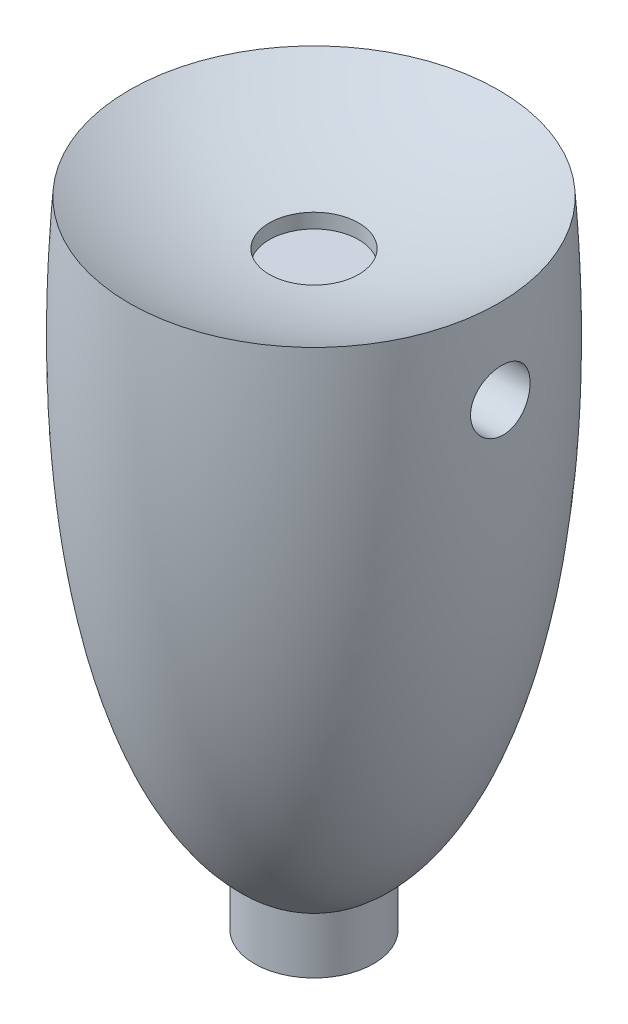
ISO-10303-21;
HEADER;
FILE_DESCRIPTION(('STEP AP214'),'2;1');
FILE_NAME('part.step','',(''),(''),'','','');
FILE_SCHEMA(('AUTOMOTIVE_DESIGN { 1 0 10303 214 1 1 1 1 }'));
ENDSEC;
DATA;
#1=APPLICATION_CONTEXT('core data for automotive mechanical design processes');
#2=APPLICATION_PROTOCOL_DEFINITION('international standard','automotive_design',2000,#1);
#3=PRODUCT_CONTEXT('',#1,'mechanical');
#4=PRODUCT('Part','Part','',(#3));
#5=PRODUCT_RELATED_PRODUCT_CATEGORY('part','',(#4));
#6=PRODUCT_DEFINITION_FORMATION('','',#4);
#7=PRODUCT_DEFINITION_CONTEXT('part definition',#1,'design');
#8=PRODUCT_DEFINITION('design','',#6,#7);
#9=PRODUCT_DEFINITION_SHAPE('','',#8);
#10=(LENGTH_UNIT() NAMED_UNIT(*) SI_UNIT(.MILLI.,.METRE.));
#11=(NAMED_UNIT(*) PLANE_ANGLE_UNIT() SI_UNIT($,.RADIAN.));
#12=(NAMED_UNIT(*) SI_UNIT($,.STERADIAN.) SOLID_ANGLE_UNIT());
#13=UNCERTAINTY_MEASURE_WITH_UNIT(LENGTH_MEASURE(1.E-05),#10,'distance_accuracy_value','');
#14=(GEOMETRIC_REPRESENTATION_CONTEXT(3) GLOBAL_UNCERTAINTY_ASSIGNED_CONTEXT((#13)) GLOBAL_UNIT_ASSIGNED_CONTEXT((#10,
#11,#12)) REPRESENTATION_CONTEXT('',''));
#15=CARTESIAN_POINT('',(0.,0.,0.));
#16=DIRECTION('',(0.,0.,1.));
#17=DIRECTION('',(1.,0.,0.));
#18=AXIS2_PLACEMENT_3D('',#15,#16,#17);
#19=CARTESIAN_POINT('',(0.,-10.1519784077534,0.));
#20=CARTESIAN_POINT('',(2.17764254721948,-9.8573338842702,0.));
#21=CARTESIAN_POINT('',(3.51506536185623,-5.79349801081051,0.));
#22=CARTESIAN_POINT('',(3.1,0.,0.));
#23=B_SPLINE_CURVE_WITH_KNOTS('',3,(#19,#20,#21,#22),.UNSPECIFIED.,.F.,.F.,(4,4),(0.,1.),.UNSPECIFIED.);
#24=CARTESIAN_POINT('',(0.,-10.1519784077534,0.));
#25=DIRECTION('',(0.,-1.,0.));
#26=AXIS1_PLACEMENT('',#24,#25);
#27=SURFACE_OF_REVOLUTION('',#23,#26);
#28=CARTESIAN_POINT('',(0.,-9.71155117708595,0.));
#29=DIRECTION('',(0.,-1.,0.));
#30=DIRECTION('',(0.,0.,-1.));
#31=AXIS2_PLACEMENT_3D('',#28,#29,#30);
#32=CIRCLE('',#31,1.);
#33=CARTESIAN_POINT('',(0.,-9.71155117708595,-1.));
#34=VERTEX_POINT('',#33);
#35=EDGE_CURVE('E11',#34,#34,#32,.T.);
#36=ORIENTED_EDGE('',*,*,#35,.F.);
#37=EDGE_LOOP('',(#36));
#38=FACE_BOUND('',#37,.T.);
#39=CARTESIAN_POINT('',(0.,0.,0.));
#40=DIRECTION('',(0.,-1.,0.));
#41=DIRECTION('',(0.,0.,-1.));
#42=AXIS2_PLACEMENT_3D('',#39,#40,#41);
#43=CIRCLE('',#42,3.1);
#44=CARTESIAN_POINT('',(0.,0.,-3.1));
#45=VERTEX_POINT('',#44);
#46=EDGE_CURVE('E49',#45,#45,#43,.T.);
#47=ORIENTED_EDGE('',*,*,#46,.T.);
#48=EDGE_LOOP('',(#47));
#49=FACE_BOUND('',#48,.T.);
#50=CARTESIAN_POINT('',(3.17478547305624,-1.87731371299007,0.));
#51=CARTESIAN_POINT('',(3.17478708095935,-1.87731880184838,-0.0278991793233904));
#52=CARTESIAN_POINT('',(3.17440053766165,-1.87497659899603,-0.0557705429527798));
#53=CARTESIAN_POINT('',(3.17289561225656,-1.8656875755126,-0.110757315431953));
#54=CARTESIAN_POINT('',(3.17177649487449,-1.85873612855486,-0.137871936210802));
#55=CARTESIAN_POINT('',(3.16891619118301,-1.84044363752771,-0.190488959148186));
#56=CARTESIAN_POINT('',(3.16717598888102,-1.82910953470292,-0.215993836883982));
#57=CARTESIAN_POINT('',(3.16323892698663,-1.80236521737027,-0.264775100218677));
#58=CARTESIAN_POINT('',(3.1610414385232,-1.78694938152737,-0.288048351761007));
#59=CARTESIAN_POINT('',(3.15638274285568,-1.75235553650844,-0.331855899819433));
#60=CARTESIAN_POINT('',(3.15391972717289,-1.73315087831825,-0.352368955936288));
#61=CARTESIAN_POINT('',(3.14897616915257,-1.69158380888654,-0.389895327703351));
#62=CARTESIAN_POINT('',(3.14649562636997,-1.66922131718121,-0.406908554148302));
#63=CARTESIAN_POINT('',(3.14172713866212,-1.621752395413,-0.437089505664033));
#64=CARTESIAN_POINT('',(3.13944096207905,-1.59662474242629,-0.450224160537847));
#65=CARTESIAN_POINT('',(3.13529661745251,-1.5445191936671,-0.472058336658953));
#66=CARTESIAN_POINT('',(3.13343784674159,-1.51754397365096,-0.480764124148514));
#67=CARTESIAN_POINT('',(3.13031080139519,-1.46261237734369,-0.4934723680727));
#68=CARTESIAN_POINT('',(3.12903969767751,-1.43466141351258,-0.497497502684638));
#69=CARTESIAN_POINT('',(3.12716452356149,-1.37845908652033,-0.500790323557148));
#70=CARTESIAN_POINT('',(3.12656040958641,-1.35020774310581,-0.500058320639419));
#71=CARTESIAN_POINT('',(3.12603330957158,-1.29449498225612,-0.493881647411546));
#72=CARTESIAN_POINT('',(3.12610382719346,-1.2670285803121,-0.488482379257165));
#73=CARTESIAN_POINT('',(3.12684568825765,-1.21338680141548,-0.473186891796732));
#74=CARTESIAN_POINT('',(3.12751703483141,-1.18721143119237,-0.463290649052981));
#75=CARTESIAN_POINT('',(3.12932945536474,-1.13690660587306,-0.439295470064482));
#76=CARTESIAN_POINT('',(3.13047018215669,-1.11277565453734,-0.425199642079995));
#77=CARTESIAN_POINT('',(3.13304566424098,-1.06716507943588,-0.393173896204928));
#78=CARTESIAN_POINT('',(3.13448092143089,-1.04569008303784,-0.375237431340686));
#79=CARTESIAN_POINT('',(3.1374513615303,-1.00587599909418,-0.33589183622));
#80=CARTESIAN_POINT('',(3.138987228538,-0.987562320901558,-0.314457039480713));
#81=CARTESIAN_POINT('',(3.14193535211081,-0.95481459561071,-0.268851761822396));
#82=CARTESIAN_POINT('',(3.14334781128846,-0.94037410556911,-0.244685920329104));
#83=CARTESIAN_POINT('',(3.1458680220724,-0.915699986292174,-0.194178479893189));
#84=CARTESIAN_POINT('',(3.14697474652728,-0.905480482367736,-0.167829924099216));
#85=CARTESIAN_POINT('',(3.14873065316615,-0.889616595975861,-0.113775404930868));
#86=CARTESIAN_POINT('',(3.14937985379845,-0.883972029036072,-0.0860694963359673));
#87=CARTESIAN_POINT('',(3.15013323159845,-0.877443529933449,-0.0302501556152628));
#88=CARTESIAN_POINT('',(3.15024039415719,-0.876533520383858,-0.00213981277784649));
#89=CARTESIAN_POINT('',(3.14990384833927,-0.879430861900544,0.0538329023684408));
#90=CARTESIAN_POINT('',(3.14946015032202,-0.883238124254565,0.0816952793305937));
#91=CARTESIAN_POINT('',(3.14808234823101,-0.895433361380588,0.136272753409917));
#92=CARTESIAN_POINT('',(3.14715012939539,-0.90380373174722,0.162991836795549));
#93=CARTESIAN_POINT('',(3.14491571186426,-0.92488583044875,0.214684112276624));
#94=CARTESIAN_POINT('',(3.14361300553247,-0.937603520275983,0.23965484990609));
#95=CARTESIAN_POINT('',(3.14080318281096,-0.96707802444443,0.287215208650524));
#96=CARTESIAN_POINT('',(3.13929525389411,-0.983851111166654,0.309794696209833));
#97=CARTESIAN_POINT('',(3.13628255582949,-1.02093970144595,0.351828381788151));
#98=CARTESIAN_POINT('',(3.13477778672209,-1.04125525000298,0.371282540100006));
#99=CARTESIAN_POINT('',(3.13197575813809,-1.08497497604795,0.406610138255714));
#100=CARTESIAN_POINT('',(3.13067957088492,-1.10839405061635,0.422465238092781));
#101=CARTESIAN_POINT('',(3.12850317569369,-1.15754891697774,0.449995385219111));
#102=CARTESIAN_POINT('',(3.12762240426276,-1.18328151380503,0.461676089643306));
#103=CARTESIAN_POINT('',(3.12643252791742,-1.23625251455718,0.480508850281019));
#104=CARTESIAN_POINT('',(3.12612118447553,-1.26348458664134,0.487678566738878));
#105=CARTESIAN_POINT('',(3.12615622155603,-1.31876419148722,0.497352210094465));
#106=CARTESIAN_POINT('',(3.12650256973942,-1.34681168408757,0.499856366387889));
#107=CARTESIAN_POINT('',(3.1278655907096,-1.4026983253111,0.500130574460554));
#108=CARTESIAN_POINT('',(3.12887713725463,-1.43053743351936,0.497936542604115));
#109=CARTESIAN_POINT('',(3.13150839532349,-1.48547163133475,0.488955543278976));
#110=CARTESIAN_POINT('',(3.13312890093751,-1.51256569967658,0.482162569420838));
#111=CARTESIAN_POINT('',(3.13685371398678,-1.56527548962039,0.464163423106086));
#112=CARTESIAN_POINT('',(3.13895906616245,-1.59088786718616,0.452947682813757));
#113=CARTESIAN_POINT('',(3.14346815214367,-1.63987123648899,0.426426321075566));
#114=CARTESIAN_POINT('',(3.14587190773112,-1.6632420643836,0.411120400973721));
#115=CARTESIAN_POINT('',(3.15078648361822,-1.70734844593393,0.376654679263064));
#116=CARTESIAN_POINT('',(3.15329818334532,-1.72805261255254,0.357454816664237));
#117=CARTESIAN_POINT('',(3.15816271320432,-1.76592367972924,0.315867736924964));
#118=CARTESIAN_POINT('',(3.16051575194437,-1.78309528837735,0.293484830272938));
#119=CARTESIAN_POINT('',(3.16484840914021,-1.81350950779317,0.246028021846784));
#120=CARTESIAN_POINT('',(3.16682652328453,-1.82673640795442,0.220943887421399));
#121=CARTESIAN_POINT('',(3.17020143130661,-1.84876664601042,0.168912594172564));
#122=CARTESIAN_POINT('',(3.17159885680928,-1.85757479243249,0.14196749696498));
#123=CARTESIAN_POINT('',(3.17404290677983,-1.87283592682287,0.0769992193021197));
#124=CARTESIAN_POINT('',(3.17478325574671,-1.8773066954192,0.0384731616531273));
#125=CARTESIAN_POINT('',(3.17478547305624,-1.87731371299007,0.));
#126=B_SPLINE_CURVE_WITH_KNOTS('',3,(#50,#51,#52,#53,#54,#55,#56,#57,#58,#59,#60,#61,#62,#63,
#64,#65,#66,#67,#68,#69,#70,#71,#72,#73,#74,#75,#76,#77,#78,#79,#80,#81,#82,#83,#84,#85,#86,#87,
#88,#89,#90,#91,#92,#93,#94,#95,#96,#97,#98,#99,#100,#101,#102,#103,#104,#105,#106,#107,#108,
#109,#110,#111,#112,#113,#114,#115,#116,#117,#118,#119,#120,#121,#122,#123,#124,#125),
.UNSPECIFIED.,.T.,.F.,(4,2,2,2,2,2,2,2,2,2,2,2,2,2,2,2,2,2,2,2,2,2,2,2,2,2,2,2,2,2,2,2,2,2,2,2,
2,4),(0.,0.0835498977455111,0.167183782236464,0.250685746475008,0.334303312661172,
0.418531444494807,0.502761722907598,0.587690714611279,0.67249920684741,0.756895059454174,
0.841285397862878,0.924863927056257,1.00844289185603,1.0919601499625,1.17562092626784,
1.25992563961596,1.34408923215289,1.4285322353798,1.51297183349433,1.59694585206099,
1.68091829144974,1.76456903572791,1.84833495378682,1.9324427316559,2.01655157802565,
2.10107985595127,2.18549314295022,2.26957386639048,2.35365045565083,2.43708659811476,
2.52063192204135,2.60435898113302,2.68809215546266,2.77273498144636,2.85726425647079,
2.9421258237094,3.02689484241943,3.14211073048573),.UNSPECIFIED.);
#127=CARTESIAN_POINT('',(3.17478547305624,-1.87731371299007,0.));
#128=VERTEX_POINT('',#127);
#129=EDGE_CURVE('E79',#128,#128,#126,.T.);
#130=ORIENTED_EDGE('',*,*,#129,.F.);
#131=EDGE_LOOP('',(#130));
#132=FACE_BOUND('',#131,.T.);
#133=CARTESIAN_POINT('',(-3.12724733851504,-1.3773137066916,0.500000006298404));
#134=CARTESIAN_POINT('',(-3.12794899310868,-1.40534559948441,0.500004937063918));
#135=CARTESIAN_POINT('',(-3.12898922620838,-1.43334161500568,0.497640629590278));
#136=CARTESIAN_POINT('',(-3.13168098366054,-1.4885588191283,0.488269994399751));
#137=CARTESIAN_POINT('',(-3.13333314765354,-1.51577916475792,0.481258803301957));
#138=CARTESIAN_POINT('',(-3.13711368970213,-1.56858786917043,0.462813125803481));
#139=CARTESIAN_POINT('',(-3.13924130589677,-1.59417875561358,0.451385694818666));
#140=CARTESIAN_POINT('',(-3.14379017902511,-1.64311201776067,0.424420280923238));
#141=CARTESIAN_POINT('',(-3.14621183840356,-1.66645123152975,0.408876629177943));
#142=CARTESIAN_POINT('',(-3.15114154314165,-1.71035045216705,0.374002184967585));
#143=CARTESIAN_POINT('',(-3.15365005534976,-1.73089097520013,0.354646930176054));
#144=CARTESIAN_POINT('',(-3.15850041328592,-1.76843834366282,0.312750325714614));
#145=CARTESIAN_POINT('',(-3.16084226228905,-1.78544525854367,0.290209038679166));
#146=CARTESIAN_POINT('',(-3.16514007219897,-1.81548942275379,0.242486034192395));
#147=CARTESIAN_POINT('',(-3.16709480839847,-1.82851414213937,0.217296310883226));
#148=CARTESIAN_POINT('',(-3.17041334467469,-1.85011941591312,0.165081344907625));
#149=CARTESIAN_POINT('',(-3.17177796844562,-1.85870616822189,0.138058722039861));
#150=CARTESIAN_POINT('',(-3.17377387072742,-1.87114029342022,0.0831830062032934));
#151=CARTESIAN_POINT('',(-3.17441186333046,-1.87503107754472,0.0553399964117887));
#152=CARTESIAN_POINT('',(-3.17491365592418,-1.87809756857496,-0.000610539716770492));
#153=CARTESIAN_POINT('',(-3.17477750466407,-1.87727357237876,-0.0287180492865262));
#154=CARTESIAN_POINT('',(-3.17374981965908,-1.87096782514322,-0.0841152192926145));
#155=CARTESIAN_POINT('',(-3.17286557554871,-1.86553102119066,-0.111410149988185));
#156=CARTESIAN_POINT('',(-3.17043609385477,-1.85021375643051,-0.164730102023622));
#157=CARTESIAN_POINT('',(-3.16888998897393,-1.84032746417158,-0.190753407007833));
#158=CARTESIAN_POINT('',(-3.16527913538382,-1.8163560818815,-0.240865370793582));
#159=CARTESIAN_POINT('',(-3.16321251263177,-1.8022557850098,-0.264946614779153));
#160=CARTESIAN_POINT('',(-3.15876051677295,-1.77027015284786,-0.310415904750141));
#161=CARTESIAN_POINT('',(-3.15637511771545,-1.75238450933341,-0.331803731196014));
#162=CARTESIAN_POINT('',(-3.15147869209416,-1.71307632475044,-0.371556767027742));
#163=CARTESIAN_POINT('',(-3.14896647361497,-1.69161263372963,-0.389881158523985));
#164=CARTESIAN_POINT('',(-3.14408419508136,-1.64593362093005,-0.42264924156315));
#165=CARTESIAN_POINT('',(-3.1417139465192,-1.62172207730739,-0.437098171837845));
#166=CARTESIAN_POINT('',(-3.13731997687738,-1.57108644492328,-0.461788558218136));
#167=CARTESIAN_POINT('',(-3.13529771281431,-1.54465371148314,-0.472012563230522));
#168=CARTESIAN_POINT('',(-3.13178987256594,-1.49040950354855,-0.487860233739124));
#169=CARTESIAN_POINT('',(-3.13030426375155,-1.46259811299462,-0.493484178949263));
#170=CARTESIAN_POINT('',(-3.1279951846866,-1.40664227021245,-0.499926084967001));
#171=CARTESIAN_POINT('',(-3.12716607752452,-1.37850280623173,-0.500785348934338));
#172=CARTESIAN_POINT('',(-3.12618662050131,-1.32246677017985,-0.497774044258075));
#173=CARTESIAN_POINT('',(-3.12603623963072,-1.29457018707014,-0.493903691710084));
#174=CARTESIAN_POINT('',(-3.12637219258864,-1.24004581314831,-0.481593644391085));
#175=CARTESIAN_POINT('',(-3.12685341254018,-1.21340961882248,-0.473190969530957));
#176=CARTESIAN_POINT('',(-3.12833515306903,-1.16188187824521,-0.452068069496956));
#177=CARTESIAN_POINT('',(-3.12933638211707,-1.13699276489903,-0.439341962195196));
#178=CARTESIAN_POINT('',(-3.13169801449025,-1.08961666372299,-0.409891245291386));
#179=CARTESIAN_POINT('',(-3.13305952690203,-1.06713739982984,-0.393154304128521));
#180=CARTESIAN_POINT('',(-3.13594100654686,-1.02528952373579,-0.356172417992681));
#181=CARTESIAN_POINT('',(-3.13746098020387,-1.00592103772549,-0.335927330778847));
#182=CARTESIAN_POINT('',(-3.14046208334438,-0.970689368417165,-0.292315941830544));
#183=CARTESIAN_POINT('',(-3.14194280948677,-0.9548551834034,-0.268926174279253));
#184=CARTESIAN_POINT('',(-3.1446508533458,-0.927356898882154,-0.219839123877733));
#185=CARTESIAN_POINT('',(-3.14587850543857,-0.915687281796009,-0.194144951037665));
#186=CARTESIAN_POINT('',(-3.14792018695346,-0.89682635842811,-0.141148448290574));
#187=CARTESIAN_POINT('',(-3.14873425304268,-0.889634655137343,-0.11384626118408));
#188=CARTESIAN_POINT('',(-3.14984179773426,-0.879940871822974,-0.0584117030849924));
#189=CARTESIAN_POINT('',(-3.15013529743592,-0.877438601729732,-0.0302793657865574));
#190=CARTESIAN_POINT('',(-3.15016322245877,-0.877198741454953,0.0258162090817303));
#191=CARTESIAN_POINT('',(-3.14990138801389,-0.879429275382655,0.0537793139039672));
#192=CARTESIAN_POINT('',(-3.14885950328712,-0.88853017497078,0.108966983235833));
#193=CARTESIAN_POINT('',(-3.14807878316051,-0.895406538258504,0.136190545703344));
#194=CARTESIAN_POINT('',(-3.14610105322072,-0.913594374693055,0.189064043262061));
#195=CARTESIAN_POINT('',(-3.1449044836223,-0.924901159440007,0.214715608810749));
#196=CARTESIAN_POINT('',(-3.14225118275939,-0.951627516169488,0.263763891192124));
#197=CARTESIAN_POINT('',(-3.14079443996096,-0.96704727050204,0.287160507988202));
#198=CARTESIAN_POINT('',(-3.13780428819114,-1.00168494395896,0.331199253541269));
#199=CARTESIAN_POINT('',(-3.13627043343129,-1.02092746276583,0.351822009999185));
#200=CARTESIAN_POINT('',(-3.13335008953176,-1.06257785126438,0.389524841150214));
#201=CARTESIAN_POINT('',(-3.13196340572176,-1.08498144585405,0.406609624900856));
#202=CARTESIAN_POINT('',(-3.12953598579358,-1.13242325449191,0.436830819809713));
#203=CARTESIAN_POINT('',(-3.12849625534079,-1.15746885508734,0.449955742708383));
#204=CARTESIAN_POINT('',(-3.12694012777067,-1.2093832101245,0.47179818389803));
#205=CARTESIAN_POINT('',(-3.12642316999533,-1.2362499783396,0.480520418898849));
#206=CARTESIAN_POINT('',(-3.12596407874268,-1.30088469397064,0.495591121352402));
#207=CARTESIAN_POINT('',(-3.1262916401963,-1.3391324804072,0.499993290281214));
#208=CARTESIAN_POINT('',(-3.12724733851504,-1.3773137066916,0.500000006298404));
#209=B_SPLINE_CURVE_WITH_KNOTS('',3,(#133,#134,#135,#136,#137,#138,#139,#140,#141,#142,#143,
#144,#145,#146,#147,#148,#149,#150,#151,#152,#153,#154,#155,#156,#157,#158,#159,#160,#161,#162,
#163,#164,#165,#166,#167,#168,#169,#170,#171,#172,#173,#174,#175,#176,#177,#178,#179,#180,#181,
#182,#183,#184,#185,#186,#187,#188,#189,#190,#191,#192,#193,#194,#195,#196,#197,#198,#199,#200,
#201,#202,#203,#204,#205,#206,#207,#208),.UNSPECIFIED.,.T.,.F.,(4,2,2,2,2,2,2,2,2,2,2,2,2,2,2,2,
2,2,2,2,2,2,2,2,2,2,2,2,2,2,2,2,2,2,2,2,2,4),(0.,0.0839748173240331,0.168037660909056,
0.251966756619454,0.336012045580479,0.420615419329855,0.505217130086085,0.590082362998172,
0.674828753430345,0.758785565023863,0.842737089766681,0.925879865069114,1.00913192514308,
1.09268811627038,1.17625111363217,1.26085144086083,1.34533682487611,1.43016777014138,
1.51499355674311,1.5990828584816,1.68316831833364,1.76657714625925,1.85009991128825,
1.93388284355932,2.01766917367807,2.10211956124077,2.18645764259417,2.27078824552135,
2.35511543033097,2.43887646690039,2.52274584361605,2.6065267059946,2.69031128344616,
2.77465358301931,2.85888289065486,2.94335426329856,3.02773494654565,3.14211400493239),.UNSPECIFIED.);
#210=CARTESIAN_POINT('',(-3.12724733851504,-1.3773137066916,0.500000006298404));
#211=VERTEX_POINT('',#210);
#212=EDGE_CURVE('E75',#211,#211,#209,.T.);
#213=ORIENTED_EDGE('',*,*,#212,.T.);
#214=EDGE_LOOP('',(#213));
#215=FACE_BOUND('',#214,.T.);
#216=ADVANCED_FACE('F42',(#38,#49,#132,#215),#27,.F.);
#217=CARTESIAN_POINT('',(0.,5.60625,0.));
#218=DIRECTION('',(0.,0.,1.));
#219=DIRECTION('',(1.,0.,0.));
#220=AXIS2_PLACEMENT_3D('',#217,#218,#219);
#221=SPHERICAL_SURFACE('',#220,6.40625);
#222=CARTESIAN_POINT('',(0.,5.60625,0.));
#223=DIRECTION('',(0.,1.,0.));
#224=DIRECTION('',(0.,0.,1.));
#225=AXIS2_PLACEMENT_3D('',#222,#223,#224);
#226=SPHERICAL_SURFACE('',#225,6.40625);
#227=CARTESIAN_POINT('',(0.,-0.755946088026524,0.));
#228=DIRECTION('',(0.,1.,0.));
#229=DIRECTION('',(0.,0.,1.));
#230=AXIS2_PLACEMENT_3D('',#227,#228,#229);
#231=CIRCLE('',#230,0.75);
#232=CARTESIAN_POINT('',(0.,-0.755946088026524,0.75));
#233=VERTEX_POINT('',#232);
#234=EDGE_CURVE('E71',#233,#233,#231,.T.);
#235=ORIENTED_EDGE('',*,*,#234,.F.);
#236=EDGE_LOOP('',(#235));
#237=FACE_BOUND('',#236,.T.);
#238=ORIENTED_EDGE('',*,*,#46,.F.);
#239=EDGE_LOOP('',(#238));
#240=FACE_BOUND('',#239,.T.);
#241=ADVANCED_FACE('F44',(#237,#240),#226,.F.);
#242=CARTESIAN_POINT('',(2.16696635955414,-1.3773137066916,0.));
#243=DIRECTION('',(1.,0.,0.));
#244=DIRECTION('',(0.,0.,-1.));
#245=AXIS2_PLACEMENT_3D('',#242,#243,#244);
#246=CYLINDRICAL_SURFACE('',#245,0.500000006298473);
#247=ORIENTED_EDGE('',*,*,#129,.T.);
#248=EDGE_LOOP('',(#247));
#249=FACE_BOUND('',#248,.T.);
#250=CARTESIAN_POINT('',(2.16696635955414,-1.3773137066916,0.));
#251=DIRECTION('',(1.,0.,0.));
#252=DIRECTION('',(0.,0.,-1.));
#253=AXIS2_PLACEMENT_3D('',#250,#251,#252);
#254=CIRCLE('',#253,0.500000006298473);
#255=CARTESIAN_POINT('',(2.16696635955414,-1.3773137066916,-0.500000006298473));
#256=VERTEX_POINT('',#255);
#257=EDGE_CURVE('E76',#256,#256,#254,.T.);
#258=ORIENTED_EDGE('',*,*,#257,.F.);
#259=EDGE_LOOP('',(#258));
#260=FACE_BOUND('',#259,.T.);
#261=ADVANCED_FACE('F92',(#249,#260),#246,.F.);
#262=CARTESIAN_POINT('',(2.16696635955414,-1.3773137066916,0.));
#263=DIRECTION('',(1.,0.,0.));
#264=DIRECTION('',(0.,0.,-1.));
#265=AXIS2_PLACEMENT_3D('',#262,#263,#264);
#266=PLANE('',#265);
#267=ORIENTED_EDGE('',*,*,#257,.T.);
#268=EDGE_LOOP('',(#267));
#269=FACE_BOUND('',#268,.T.);
#270=ADVANCED_FACE('F110',(#269),#266,.T.);
#271=CARTESIAN_POINT('',(-2.16696635955414,-1.3773137066916,0.));
#272=DIRECTION('',(-1.,0.,0.));
#273=DIRECTION('',(0.,0.,1.));
#274=AXIS2_PLACEMENT_3D('',#271,#272,#273);
#275=CYLINDRICAL_SURFACE('',#274,0.500000006298473);
#276=ORIENTED_EDGE('',*,*,#212,.F.);
#277=EDGE_LOOP('',(#276));
#278=FACE_BOUND('',#277,.T.);
#279=CARTESIAN_POINT('',(-2.16696635955414,-1.3773137066916,0.));
#280=DIRECTION('',(1.,0.,0.));
#281=DIRECTION('',(0.,0.,-1.));
#282=AXIS2_PLACEMENT_3D('',#279,#280,#281);
#283=CIRCLE('',#282,0.500000006298473);
#284=CARTESIAN_POINT('',(-2.16696635955414,-1.3773137066916,-0.500000006298473));
#285=VERTEX_POINT('',#284);
#286=EDGE_CURVE('E72',#285,#285,#283,.T.);
#287=ORIENTED_EDGE('',*,*,#286,.T.);
#288=EDGE_LOOP('',(#287));
#289=FACE_BOUND('',#288,.T.);
#290=ADVANCED_FACE('F105',(#278,#289),#275,.F.);
#291=CARTESIAN_POINT('',(-2.16696635955414,-1.3773137066916,0.));
#292=DIRECTION('',(-1.,0.,0.));
#293=DIRECTION('',(0.,0.,-1.));
#294=AXIS2_PLACEMENT_3D('',#291,#292,#293);
#295=PLANE('',#294);
#296=ORIENTED_EDGE('',*,*,#286,.F.);
#297=EDGE_LOOP('',(#296));
#298=FACE_BOUND('',#297,.T.);
#299=ADVANCED_FACE('F109',(#298),#295,.T.);
#300=CARTESIAN_POINT('',(0.,-1.,0.));
#301=DIRECTION('',(0.,1.,0.));
#302=DIRECTION('',(0.,0.,1.));
#303=AXIS2_PLACEMENT_3D('',#300,#301,#302);
#304=CYLINDRICAL_SURFACE('',#303,0.75);
#305=ORIENTED_EDGE('',*,*,#234,.T.);
#306=EDGE_LOOP('',(#305));
#307=FACE_BOUND('',#306,.T.);
#308=CARTESIAN_POINT('',(0.,-1.,0.));
#309=DIRECTION('',(0.,1.,0.));
#310=DIRECTION('',(0.,0.,1.));
#311=AXIS2_PLACEMENT_3D('',#308,#309,#310);
#312=CIRCLE('',#311,0.75);
#313=CARTESIAN_POINT('',(0.,-1.,0.75));
#314=VERTEX_POINT('',#313);
#315=EDGE_CURVE('E68',#314,#314,#312,.T.);
#316=ORIENTED_EDGE('',*,*,#315,.F.);
#317=EDGE_LOOP('',(#316));
#318=FACE_BOUND('',#317,.T.);
#319=ADVANCED_FACE('F138',(#307,#318),#304,.F.);
#320=CARTESIAN_POINT('',(0.,-1.,0.));
#321=DIRECTION('',(0.,1.,0.));
#322=DIRECTION('',(0.,0.,1.));
#323=AXIS2_PLACEMENT_3D('',#320,#321,#322);
#324=PLANE('',#323);
#325=ORIENTED_EDGE('',*,*,#315,.T.);
#326=EDGE_LOOP('',(#325));
#327=FACE_BOUND('',#326,.T.);
#328=ADVANCED_FACE('F142',(#327),#324,.T.);
#329=CARTESIAN_POINT('',(0.,-10.6519784077534,0.));
#330=DIRECTION('',(0.,1.,0.));
#331=DIRECTION('',(0.,0.,1.));
#332=AXIS2_PLACEMENT_3D('',#329,#330,#331);
#333=CYLINDRICAL_SURFACE('',#332,1.);
#334=CARTESIAN_POINT('',(0.,-10.6519784077534,0.));
#335=DIRECTION('',(0.,1.,0.));
#336=DIRECTION('',(0.,0.,1.));
#337=AXIS2_PLACEMENT_3D('',#334,#335,#336);
#338=CIRCLE('',#337,1.);
#339=CARTESIAN_POINT('',(0.,-10.6519784077534,1.));
#340=VERTEX_POINT('',#339);
#341=EDGE_CURVE('E63',#340,#340,#338,.T.);
#342=ORIENTED_EDGE('',*,*,#341,.T.);
#343=EDGE_LOOP('',(#342));
#344=FACE_BOUND('',#343,.T.);
#345=ORIENTED_EDGE('',*,*,#35,.T.);
#346=EDGE_LOOP('',(#345));
#347=FACE_BOUND('',#346,.T.);
#348=ADVANCED_FACE('F147',(#344,#347),#333,.T.);
#349=CARTESIAN_POINT('',(0.,-10.6519784077534,0.));
#350=DIRECTION('',(0.,1.,0.));
#351=DIRECTION('',(0.,0.,1.));
#352=AXIS2_PLACEMENT_3D('',#349,#350,#351);
#353=PLANE('',#352);
#354=CARTESIAN_POINT('',(0.,-10.6519784077534,0.));
#355=DIRECTION('',(0.,1.,0.));
#356=DIRECTION('',(0.,0.,1.));
#357=AXIS2_PLACEMENT_3D('',#354,#355,#356);
#358=CIRCLE('',#357,0.45);
#359=CARTESIAN_POINT('',(0.,-10.6519784077534,0.45));
#360=VERTEX_POINT('',#359);
#361=EDGE_CURVE('E60',#360,#360,#358,.T.);
#362=ORIENTED_EDGE('',*,*,#361,.T.);
#363=EDGE_LOOP('',(#362));
#364=FACE_BOUND('',#363,.T.);
#365=ORIENTED_EDGE('',*,*,#341,.F.);
#366=EDGE_LOOP('',(#365));
#367=FACE_BOUND('',#366,.T.);
#368=ADVANCED_FACE('F155',(#364,#367),#353,.F.);
#369=CARTESIAN_POINT('',(0.,-10.6519784077534,0.));
#370=DIRECTION('',(0.,1.,0.));
#371=DIRECTION('',(0.,0.,1.));
#372=AXIS2_PLACEMENT_3D('',#369,#370,#371);
#373=CYLINDRICAL_SURFACE('',#372,0.45);
#374=ORIENTED_EDGE('',*,*,#361,.F.);
#375=EDGE_LOOP('',(#374));
#376=FACE_BOUND('',#375,.T.);
#377=CARTESIAN_POINT('',(0.,-10.033268546634,0.));
#378=DIRECTION('',(0.,-1.,0.));
#379=DIRECTION('',(0.,0.,-1.));
#380=AXIS2_PLACEMENT_3D('',#377,#378,#379);
#381=CIRCLE('',#380,0.450000000000017);
#382=CARTESIAN_POINT('',(0.,-10.033268546634,-0.450000000000017));
#383=VERTEX_POINT('',#382);
#384=EDGE_CURVE('E58',#383,#383,#381,.T.);
#385=ORIENTED_EDGE('',*,*,#384,.F.);
#386=EDGE_LOOP('',(#385));
#387=FACE_BOUND('',#386,.T.);
#388=ADVANCED_FACE('F55',(#376,#387),#373,.F.);
#389=CARTESIAN_POINT('',(0.,-10.1519784077534,0.));
#390=VERTEX_POINT('',#389);
#391=VERTEX_LOOP('',#390);
#392=FACE_BOUND('',#391,.T.);
#393=ORIENTED_EDGE('',*,*,#384,.T.);
#394=EDGE_LOOP('',(#393));
#395=FACE_BOUND('',#394,.T.);
#396=ADVANCED_FACE('F52',(#392,#395),#27,.F.);
#397=CLOSED_SHELL('',(#216,#241,#261,#270,#290,#299,#319,#328,#348,#368,#388,#396));
#398=MANIFOLD_SOLID_BREP('B2',#397);
#399=ADVANCED_BREP_SHAPE_REPRESENTATION('',(#18,#398),#14);
#400=SHAPE_DEFINITION_REPRESENTATION(#9,#399);
ENDSEC;
END-ISO-10303-21;
